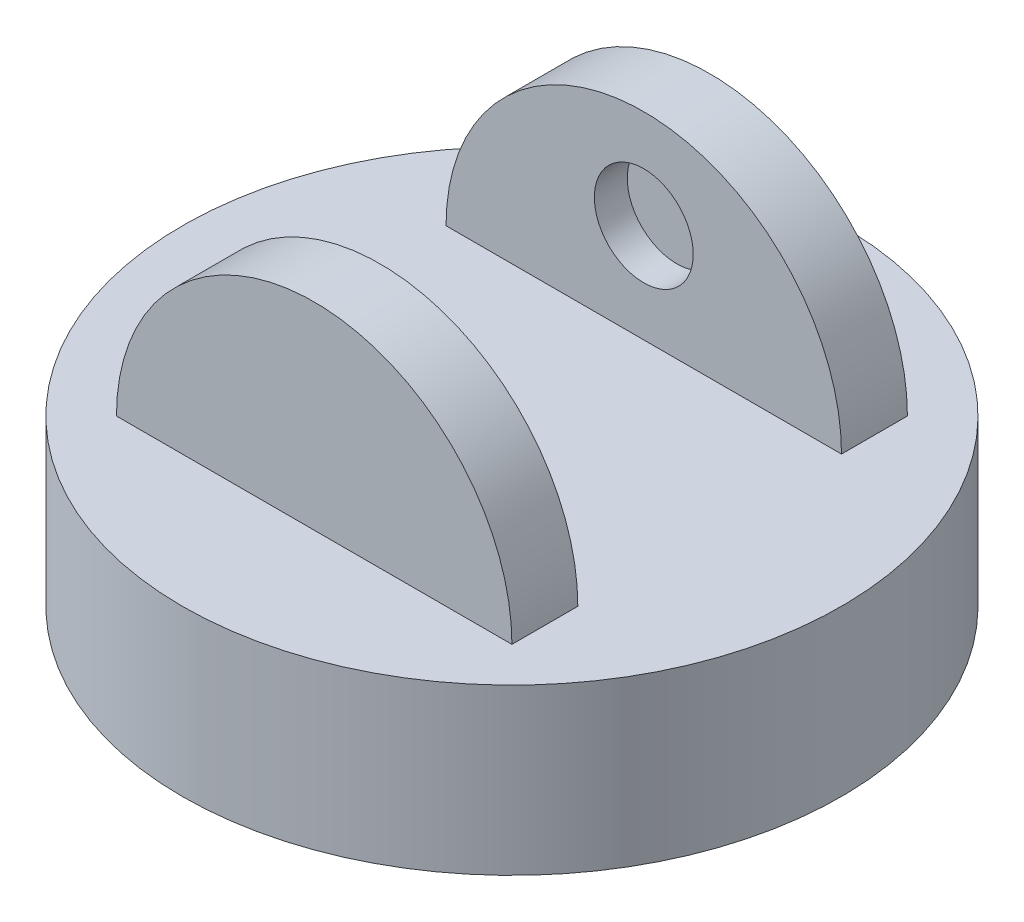
ISO-10303-21;
HEADER;
FILE_DESCRIPTION(('STEP AP214'),'2;1');
FILE_NAME('part.step','',(''),(''),'','','');
FILE_SCHEMA(('AUTOMOTIVE_DESIGN { 1 0 10303 214 1 1 1 1 }'));
ENDSEC;
DATA;
#1=APPLICATION_CONTEXT('core data for automotive mechanical design processes');
#2=APPLICATION_PROTOCOL_DEFINITION('international standard','automotive_design',2000,#1);
#3=PRODUCT_CONTEXT('',#1,'mechanical');
#4=PRODUCT('Part','Part','',(#3));
#5=PRODUCT_RELATED_PRODUCT_CATEGORY('part','',(#4));
#6=PRODUCT_DEFINITION_FORMATION('','',#4);
#7=PRODUCT_DEFINITION_CONTEXT('part definition',#1,'design');
#8=PRODUCT_DEFINITION('design','',#6,#7);
#9=PRODUCT_DEFINITION_SHAPE('','',#8);
#10=(LENGTH_UNIT() NAMED_UNIT(*) SI_UNIT(.MILLI.,.METRE.));
#11=(NAMED_UNIT(*) PLANE_ANGLE_UNIT() SI_UNIT($,.RADIAN.));
#12=(NAMED_UNIT(*) SI_UNIT($,.STERADIAN.) SOLID_ANGLE_UNIT());
#13=UNCERTAINTY_MEASURE_WITH_UNIT(LENGTH_MEASURE(1.E-05),#10,'distance_accuracy_value','');
#14=(GEOMETRIC_REPRESENTATION_CONTEXT(3) GLOBAL_UNCERTAINTY_ASSIGNED_CONTEXT((#13)) GLOBAL_UNIT_ASSIGNED_CONTEXT((#10,
#11,#12)) REPRESENTATION_CONTEXT('',''));
#15=CARTESIAN_POINT('',(0.,0.,0.));
#16=DIRECTION('',(0.,0.,1.));
#17=DIRECTION('',(1.,0.,0.));
#18=AXIS2_PLACEMENT_3D('',#15,#16,#17);
#19=CARTESIAN_POINT('',(0.,50.,60.));
#20=DIRECTION('',(0.,0.,-1.));
#21=DIRECTION('',(-1.,0.,0.));
#22=AXIS2_PLACEMENT_3D('',#19,#20,#21);
#23=CYLINDRICAL_SURFACE('',#22,60.);
#24=CARTESIAN_POINT('',(0.,50.,40.));
#25=DIRECTION('',(0.,0.,-1.));
#26=DIRECTION('',(-1.,0.,0.));
#27=AXIS2_PLACEMENT_3D('',#24,#25,#26);
#28=CIRCLE('',#27,60.);
#29=CARTESIAN_POINT('',(-60.,50.,40.));
#30=VERTEX_POINT('',#29);
#31=CARTESIAN_POINT('',(60.,50.,40.));
#32=VERTEX_POINT('',#31);
#33=EDGE_CURVE('E11',#30,#32,#28,.T.);
#34=ORIENTED_EDGE('',*,*,#33,.F.);
#35=DIRECTION('',(0.,0.,-1.));
#36=VECTOR('',#35,1.);
#37=CARTESIAN_POINT('',(-60.,50.,60.));
#38=LINE('',#37,#36);
#39=CARTESIAN_POINT('',(-60.,50.,60.));
#40=VERTEX_POINT('',#39);
#41=EDGE_CURVE('E80',#40,#30,#38,.T.);
#42=ORIENTED_EDGE('',*,*,#41,.F.);
#43=CARTESIAN_POINT('',(0.,50.,60.));
#44=DIRECTION('',(0.,0.,1.));
#45=DIRECTION('',(-1.,0.,0.));
#46=AXIS2_PLACEMENT_3D('',#43,#44,#45);
#47=CIRCLE('',#46,60.);
#48=CARTESIAN_POINT('',(60.,50.,60.));
#49=VERTEX_POINT('',#48);
#50=EDGE_CURVE('E113',#49,#40,#47,.T.);
#51=ORIENTED_EDGE('',*,*,#50,.F.);
#52=DIRECTION('',(0.,0.,-1.));
#53=VECTOR('',#52,1.);
#54=CARTESIAN_POINT('',(60.,50.,60.));
#55=LINE('',#54,#53);
#56=EDGE_CURVE('E54',#49,#32,#55,.T.);
#57=ORIENTED_EDGE('',*,*,#56,.T.);
#58=EDGE_LOOP('',(#34,#42,#51,#57));
#59=FACE_BOUND('',#58,.T.);
#60=ADVANCED_FACE('F35',(#59),#23,.T.);
#61=CARTESIAN_POINT('',(0.,50.,-40.));
#62=DIRECTION('',(0.,0.,1.));
#63=DIRECTION('',(1.,0.,0.));
#64=AXIS2_PLACEMENT_3D('',#61,#62,#63);
#65=CIRCLE('',#64,60.);
#66=CARTESIAN_POINT('',(60.,50.,-40.));
#67=VERTEX_POINT('',#66);
#68=CARTESIAN_POINT('',(-60.,50.,-40.));
#69=VERTEX_POINT('',#68);
#70=EDGE_CURVE('E43',#67,#69,#65,.T.);
#71=ORIENTED_EDGE('',*,*,#70,.F.);
#72=CARTESIAN_POINT('',(60.,50.,-60.));
#73=VERTEX_POINT('',#72);
#74=EDGE_CURVE('E105',#67,#73,#55,.T.);
#75=ORIENTED_EDGE('',*,*,#74,.T.);
#76=CARTESIAN_POINT('',(0.,50.,-60.));
#77=DIRECTION('',(0.,0.,-1.));
#78=DIRECTION('',(-1.,0.,0.));
#79=AXIS2_PLACEMENT_3D('',#76,#77,#78);
#80=CIRCLE('',#79,60.);
#81=CARTESIAN_POINT('',(-60.,50.,-60.));
#82=VERTEX_POINT('',#81);
#83=EDGE_CURVE('E110',#82,#73,#80,.T.);
#84=ORIENTED_EDGE('',*,*,#83,.F.);
#85=EDGE_CURVE('E86',#69,#82,#38,.T.);
#86=ORIENTED_EDGE('',*,*,#85,.F.);
#87=EDGE_LOOP('',(#71,#75,#84,#86));
#88=FACE_BOUND('',#87,.T.);
#89=ADVANCED_FACE('F108',(#88),#23,.T.);
#90=CARTESIAN_POINT('',(0.,50.,0.));
#91=DIRECTION('',(0.,1.,0.));
#92=DIRECTION('',(0.,0.,1.));
#93=AXIS2_PLACEMENT_3D('',#90,#91,#92);
#94=PLANE('',#93);
#95=ORIENTED_EDGE('',*,*,#41,.T.);
#96=DIRECTION('',(1.,0.,0.));
#97=VECTOR('',#96,1.);
#98=CARTESIAN_POINT('',(60.,50.,40.));
#99=LINE('',#98,#97);
#100=EDGE_CURVE('E50',#30,#32,#99,.T.);
#101=ORIENTED_EDGE('',*,*,#100,.T.);
#102=ORIENTED_EDGE('',*,*,#56,.F.);
#103=DIRECTION('',(1.,0.,0.));
#104=VECTOR('',#103,1.);
#105=CARTESIAN_POINT('',(-60.,50.,60.));
#106=LINE('',#105,#104);
#107=EDGE_CURVE('E83',#40,#49,#106,.T.);
#108=ORIENTED_EDGE('',*,*,#107,.F.);
#109=EDGE_LOOP('',(#95,#101,#102,#108));
#110=FACE_BOUND('',#109,.T.);
#111=CARTESIAN_POINT('',(0.,50.,0.));
#112=DIRECTION('',(0.,1.,0.));
#113=DIRECTION('',(0.,0.,1.));
#114=AXIS2_PLACEMENT_3D('',#111,#112,#113);
#115=CIRCLE('',#114,100.);
#116=CARTESIAN_POINT('',(0.,50.,100.));
#117=VERTEX_POINT('',#116);
#118=EDGE_CURVE('E89',#117,#117,#115,.T.);
#119=ORIENTED_EDGE('',*,*,#118,.T.);
#120=EDGE_LOOP('',(#119));
#121=FACE_BOUND('',#120,.T.);
#122=DIRECTION('',(-1.,0.,0.));
#123=VECTOR('',#122,1.);
#124=CARTESIAN_POINT('',(60.,50.,-40.));
#125=LINE('',#124,#123);
#126=EDGE_CURVE('E74',#67,#69,#125,.T.);
#127=ORIENTED_EDGE('',*,*,#126,.T.);
#128=ORIENTED_EDGE('',*,*,#85,.T.);
#129=DIRECTION('',(-1.,0.,0.));
#130=VECTOR('',#129,1.);
#131=CARTESIAN_POINT('',(0.,50.,-60.));
#132=LINE('',#131,#130);
#133=EDGE_CURVE('E106',#73,#82,#132,.T.);
#134=ORIENTED_EDGE('',*,*,#133,.F.);
#135=ORIENTED_EDGE('',*,*,#74,.F.);
#136=EDGE_LOOP('',(#127,#128,#134,#135));
#137=FACE_BOUND('',#136,.T.);
#138=ADVANCED_FACE('F81',(#110,#121,#137),#94,.T.);
#139=CARTESIAN_POINT('',(0.,50.,0.));
#140=DIRECTION('',(0.,-1.,0.));
#141=DIRECTION('',(0.,0.,-1.));
#142=AXIS2_PLACEMENT_3D('',#139,#140,#141);
#143=CYLINDRICAL_SURFACE('',#142,100.);
#144=ORIENTED_EDGE('',*,*,#118,.F.);
#145=EDGE_LOOP('',(#144));
#146=FACE_BOUND('',#145,.T.);
#147=CARTESIAN_POINT('',(0.,0.,0.));
#148=DIRECTION('',(0.,1.,0.));
#149=DIRECTION('',(0.,0.,1.));
#150=AXIS2_PLACEMENT_3D('',#147,#148,#149);
#151=CIRCLE('',#150,100.);
#152=CARTESIAN_POINT('',(0.,0.,100.));
#153=VERTEX_POINT('',#152);
#154=EDGE_CURVE('E85',#153,#153,#151,.T.);
#155=ORIENTED_EDGE('',*,*,#154,.T.);
#156=EDGE_LOOP('',(#155));
#157=FACE_BOUND('',#156,.T.);
#158=ADVANCED_FACE('F37',(#146,#157),#143,.T.);
#159=CARTESIAN_POINT('',(0.,0.,0.));
#160=DIRECTION('',(0.,1.,0.));
#161=DIRECTION('',(0.,0.,1.));
#162=AXIS2_PLACEMENT_3D('',#159,#160,#161);
#163=PLANE('',#162);
#164=ORIENTED_EDGE('',*,*,#154,.F.);
#165=EDGE_LOOP('',(#164));
#166=FACE_BOUND('',#165,.T.);
#167=ADVANCED_FACE('F121',(#166),#163,.F.);
#168=CARTESIAN_POINT('',(0.,50.,60.));
#169=DIRECTION('',(0.,0.,-1.));
#170=DIRECTION('',(-1.,0.,0.));
#171=AXIS2_PLACEMENT_3D('',#168,#169,#170);
#172=PLANE('',#171);
#173=ORIENTED_EDGE('',*,*,#50,.T.);
#174=ORIENTED_EDGE('',*,*,#107,.T.);
#175=EDGE_LOOP('',(#173,#174));
#176=FACE_BOUND('',#175,.T.);
#177=ADVANCED_FACE('F119',(#176),#172,.F.);
#178=CARTESIAN_POINT('',(0.,0.,-60.));
#179=DIRECTION('',(0.,0.,-1.));
#180=DIRECTION('',(-1.,0.,0.));
#181=AXIS2_PLACEMENT_3D('',#178,#179,#180);
#182=PLANE('',#181);
#183=ORIENTED_EDGE('',*,*,#133,.T.);
#184=ORIENTED_EDGE('',*,*,#83,.T.);
#185=EDGE_LOOP('',(#183,#184));
#186=FACE_BOUND('',#185,.T.);
#187=ADVANCED_FACE('F115',(#186),#182,.T.);
#188=CARTESIAN_POINT('',(60.,118.,40.));
#189=DIRECTION('',(0.,0.,-1.));
#190=DIRECTION('',(-1.,0.,0.));
#191=AXIS2_PLACEMENT_3D('',#188,#189,#190);
#192=PLANE('',#191);
#193=CARTESIAN_POINT('',(0.,80.,40.));
#194=DIRECTION('',(0.,0.,-1.));
#195=DIRECTION('',(-1.,0.,0.));
#196=AXIS2_PLACEMENT_3D('',#193,#194,#195);
#197=CIRCLE('',#196,15.);
#198=CARTESIAN_POINT('',(-15.,80.,40.));
#199=VERTEX_POINT('',#198);
#200=EDGE_CURVE('E241',#199,#199,#197,.T.);
#201=ORIENTED_EDGE('',*,*,#200,.F.);
#202=EDGE_LOOP('',(#201));
#203=FACE_BOUND('',#202,.T.);
#204=ORIENTED_EDGE('',*,*,#33,.T.);
#205=ORIENTED_EDGE('',*,*,#100,.F.);
#206=EDGE_LOOP('',(#204,#205));
#207=FACE_BOUND('',#206,.T.);
#208=ADVANCED_FACE('F73',(#203,#207),#192,.T.);
#209=CARTESIAN_POINT('',(60.,118.,-40.));
#210=DIRECTION('',(0.,0.,1.));
#211=DIRECTION('',(1.,0.,0.));
#212=AXIS2_PLACEMENT_3D('',#209,#210,#211);
#213=PLANE('',#212);
#214=CARTESIAN_POINT('',(0.,80.,-40.));
#215=DIRECTION('',(0.,0.,1.));
#216=DIRECTION('',(1.,0.,0.));
#217=AXIS2_PLACEMENT_3D('',#214,#215,#216);
#218=CIRCLE('',#217,15.);
#219=CARTESIAN_POINT('',(15.,80.,-40.));
#220=VERTEX_POINT('',#219);
#221=EDGE_CURVE('E242',#220,#220,#218,.T.);
#222=ORIENTED_EDGE('',*,*,#221,.F.);
#223=EDGE_LOOP('',(#222));
#224=FACE_BOUND('',#223,.T.);
#225=ORIENTED_EDGE('',*,*,#70,.T.);
#226=ORIENTED_EDGE('',*,*,#126,.F.);
#227=EDGE_LOOP('',(#225,#226));
#228=FACE_BOUND('',#227,.T.);
#229=ADVANCED_FACE('F98',(#224,#228),#213,.T.);
#230=CARTESIAN_POINT('',(0.,80.,50.));
#231=DIRECTION('',(0.,0.,-1.));
#232=DIRECTION('',(-1.,0.,0.));
#233=AXIS2_PLACEMENT_3D('',#230,#231,#232);
#234=CYLINDRICAL_SURFACE('',#233,15.);
#235=CARTESIAN_POINT('',(0.,80.,50.));
#236=DIRECTION('',(0.,0.,-1.));
#237=DIRECTION('',(-1.,0.,0.));
#238=AXIS2_PLACEMENT_3D('',#235,#236,#237);
#239=CIRCLE('',#238,15.);
#240=CARTESIAN_POINT('',(-15.,80.,50.));
#241=VERTEX_POINT('',#240);
#242=EDGE_CURVE('E75',#241,#241,#239,.T.);
#243=ORIENTED_EDGE('',*,*,#242,.F.);
#244=EDGE_LOOP('',(#243));
#245=FACE_BOUND('',#244,.T.);
#246=ORIENTED_EDGE('',*,*,#200,.T.);
#247=EDGE_LOOP('',(#246));
#248=FACE_BOUND('',#247,.T.);
#249=ADVANCED_FACE('F192',(#245,#248),#234,.F.);
#250=CARTESIAN_POINT('',(0.,80.,50.));
#251=DIRECTION('',(0.,0.,-1.));
#252=DIRECTION('',(-1.,0.,0.));
#253=AXIS2_PLACEMENT_3D('',#250,#251,#252);
#254=PLANE('',#253);
#255=ORIENTED_EDGE('',*,*,#242,.T.);
#256=EDGE_LOOP('',(#255));
#257=FACE_BOUND('',#256,.T.);
#258=ADVANCED_FACE('F197',(#257),#254,.T.);
#259=CARTESIAN_POINT('',(0.,80.,-50.));
#260=DIRECTION('',(0.,0.,1.));
#261=DIRECTION('',(1.,0.,0.));
#262=AXIS2_PLACEMENT_3D('',#259,#260,#261);
#263=CYLINDRICAL_SURFACE('',#262,15.);
#264=CARTESIAN_POINT('',(0.,80.,-50.));
#265=DIRECTION('',(0.,0.,1.));
#266=DIRECTION('',(1.,0.,0.));
#267=AXIS2_PLACEMENT_3D('',#264,#265,#266);
#268=CIRCLE('',#267,15.);
#269=CARTESIAN_POINT('',(15.,80.,-50.));
#270=VERTEX_POINT('',#269);
#271=EDGE_CURVE('E240',#270,#270,#268,.T.);
#272=ORIENTED_EDGE('',*,*,#271,.F.);
#273=EDGE_LOOP('',(#272));
#274=FACE_BOUND('',#273,.T.);
#275=ORIENTED_EDGE('',*,*,#221,.T.);
#276=EDGE_LOOP('',(#275));
#277=FACE_BOUND('',#276,.T.);
#278=ADVANCED_FACE('F207',(#274,#277),#263,.F.);
#279=CARTESIAN_POINT('',(0.,80.,-50.));
#280=DIRECTION('',(0.,0.,1.));
#281=DIRECTION('',(1.,0.,0.));
#282=AXIS2_PLACEMENT_3D('',#279,#280,#281);
#283=PLANE('',#282);
#284=ORIENTED_EDGE('',*,*,#271,.T.);
#285=EDGE_LOOP('',(#284));
#286=FACE_BOUND('',#285,.T.);
#287=ADVANCED_FACE('F224',(#286),#283,.T.);
#288=CLOSED_SHELL('',(#60,#89,#138,#158,#167,#177,#187,#208,#229,#249,#258,#278,#287));
#289=MANIFOLD_SOLID_BREP('B2',#288);
#290=ADVANCED_BREP_SHAPE_REPRESENTATION('',(#18,#289),#14);
#291=SHAPE_DEFINITION_REPRESENTATION(#9,#290);
ENDSEC;
END-ISO-10303-21;
